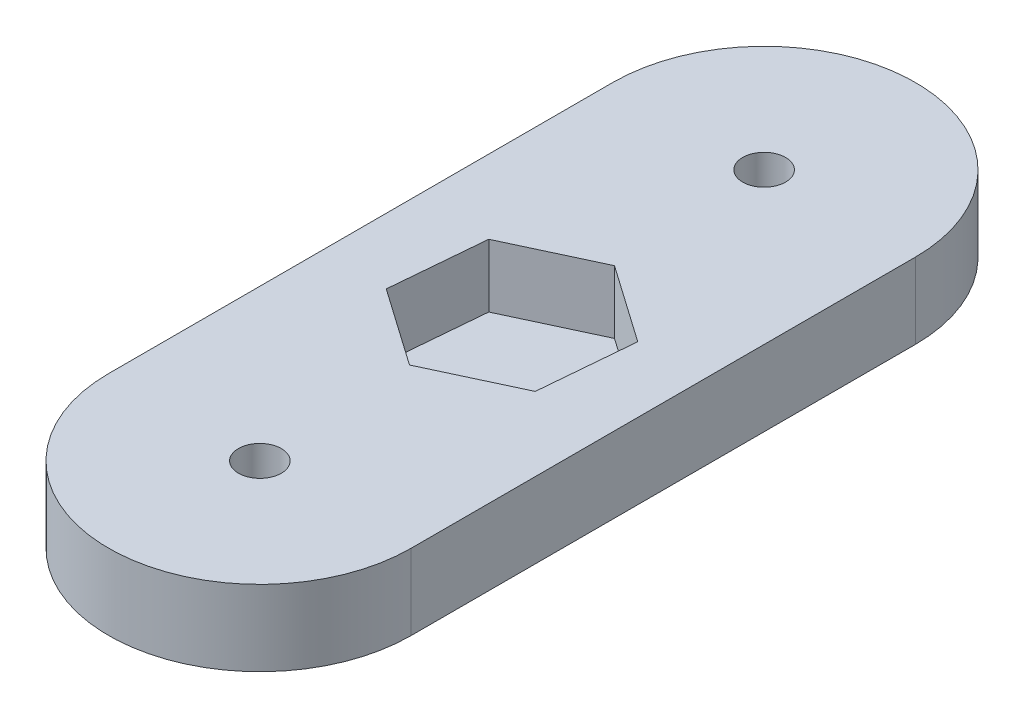
ISO-10303-21;
HEADER;
FILE_DESCRIPTION(('STEP AP214'),'2;1');
FILE_NAME('part.step','',(''),(''),'','','');
FILE_SCHEMA(('AUTOMOTIVE_DESIGN { 1 0 10303 214 1 1 1 1 }'));
ENDSEC;
DATA;
#1=APPLICATION_CONTEXT('core data for automotive mechanical design processes');
#2=APPLICATION_PROTOCOL_DEFINITION('international standard','automotive_design',2000,#1);
#3=PRODUCT_CONTEXT('',#1,'mechanical');
#4=PRODUCT('Part','Part','',(#3));
#5=PRODUCT_RELATED_PRODUCT_CATEGORY('part','',(#4));
#6=PRODUCT_DEFINITION_FORMATION('','',#4);
#7=PRODUCT_DEFINITION_CONTEXT('part definition',#1,'design');
#8=PRODUCT_DEFINITION('design','',#6,#7);
#9=PRODUCT_DEFINITION_SHAPE('','',#8);
#10=(LENGTH_UNIT() NAMED_UNIT(*) SI_UNIT(.MILLI.,.METRE.));
#11=(NAMED_UNIT(*) PLANE_ANGLE_UNIT() SI_UNIT($,.RADIAN.));
#12=(NAMED_UNIT(*) SI_UNIT($,.STERADIAN.) SOLID_ANGLE_UNIT());
#13=UNCERTAINTY_MEASURE_WITH_UNIT(LENGTH_MEASURE(1.E-05),#10,'distance_accuracy_value','');
#14=(GEOMETRIC_REPRESENTATION_CONTEXT(3) GLOBAL_UNCERTAINTY_ASSIGNED_CONTEXT((#13)) GLOBAL_UNIT_ASSIGNED_CONTEXT((#10,
#11,#12)) REPRESENTATION_CONTEXT('',''));
#15=CARTESIAN_POINT('',(0.,0.,0.));
#16=DIRECTION('',(0.,0.,1.));
#17=DIRECTION('',(1.,0.,0.));
#18=AXIS2_PLACEMENT_3D('',#15,#16,#17);
#19=CARTESIAN_POINT('',(0.,6.,0.));
#20=DIRECTION('',(0.,1.,0.));
#21=DIRECTION('',(0.,0.,1.));
#22=AXIS2_PLACEMENT_3D('',#19,#20,#21);
#23=PLANE('',#22);
#24=DIRECTION('',(0.906307787036648,0.,-0.422618261740703));
#25=VECTOR('',#24,1.);
#26=CARTESIAN_POINT('',(-0.654152089978134,6.,-12.5230073975889));
#27=LINE('',#26,#25);
#28=CARTESIAN_POINT('',(-0.654152089978134,6.,-12.5230073975889));
#29=VERTEX_POINT('',#28);
#30=CARTESIAN_POINT('',(6.14818949260728,6.,-15.6949913709347));
#31=VERTEX_POINT('',#30);
#32=EDGE_CURVE('E48',#29,#31,#27,.T.);
#33=ORIENTED_EDGE('',*,*,#32,.F.);
#34=DIRECTION('',(0.819152044288994,0.,0.573576436351043));
#35=VECTOR('',#34,1.);
#36=CARTESIAN_POINT('',(-6.80234158258542,6.,-16.8280160266542));
#37=LINE('',#36,#35);
#38=CARTESIAN_POINT('',(-6.80234158258542,6.,-16.8280160266542));
#39=VERTEX_POINT('',#38);
#40=EDGE_CURVE('E140',#39,#29,#37,.T.);
#41=ORIENTED_EDGE('',*,*,#40,.F.);
#42=DIRECTION('',(-0.087155742747654,0.,0.996194698091746));
#43=VECTOR('',#42,1.);
#44=CARTESIAN_POINT('',(-6.14818949260728,6.,-24.3050086290653));
#45=LINE('',#44,#43);
#46=CARTESIAN_POINT('',(-6.14818949260728,6.,-24.3050086290653));
#47=VERTEX_POINT('',#46);
#48=EDGE_CURVE('E143',#47,#39,#45,.T.);
#49=ORIENTED_EDGE('',*,*,#48,.F.);
#50=DIRECTION('',(-0.906307787036648,0.,0.422618261740703));
#51=VECTOR('',#50,1.);
#52=CARTESIAN_POINT('',(0.654152089978131,6.,-27.4769926024111));
#53=LINE('',#52,#51);
#54=CARTESIAN_POINT('',(0.654152089978131,6.,-27.4769926024111));
#55=VERTEX_POINT('',#54);
#56=EDGE_CURVE('E159',#55,#47,#53,.T.);
#57=ORIENTED_EDGE('',*,*,#56,.F.);
#58=DIRECTION('',(-0.819152044288995,0.,-0.573576436351042));
#59=VECTOR('',#58,1.);
#60=CARTESIAN_POINT('',(6.80234158258542,6.,-23.1719839733458));
#61=LINE('',#60,#59);
#62=CARTESIAN_POINT('',(6.80234158258542,6.,-23.1719839733458));
#63=VERTEX_POINT('',#62);
#64=EDGE_CURVE('E156',#63,#55,#61,.T.);
#65=ORIENTED_EDGE('',*,*,#64,.F.);
#66=DIRECTION('',(0.087155742747654,0.,-0.996194698091746));
#67=VECTOR('',#66,1.);
#68=CARTESIAN_POINT('',(6.14818949260728,6.,-15.6949913709347));
#69=LINE('',#68,#67);
#70=EDGE_CURVE('E154',#31,#63,#69,.T.);
#71=ORIENTED_EDGE('',*,*,#70,.F.);
#72=EDGE_LOOP('',(#33,#41,#49,#57,#65,#71));
#73=FACE_BOUND('',#72,.T.);
#74=CARTESIAN_POINT('',(0.,6.,-40.));
#75=DIRECTION('',(0.,1.,0.));
#76=DIRECTION('',(0.,0.,1.));
#77=AXIS2_PLACEMENT_3D('',#74,#75,#76);
#78=CIRCLE('',#77,1.7);
#79=CARTESIAN_POINT('',(0.,6.,-38.3));
#80=VERTEX_POINT('',#79);
#81=EDGE_CURVE('E180',#80,#80,#78,.T.);
#82=ORIENTED_EDGE('',*,*,#81,.F.);
#83=EDGE_LOOP('',(#82));
#84=FACE_BOUND('',#83,.T.);
#85=CARTESIAN_POINT('',(0.,6.,0.));
#86=DIRECTION('',(0.,1.,0.));
#87=DIRECTION('',(0.,0.,1.));
#88=AXIS2_PLACEMENT_3D('',#85,#86,#87);
#89=CIRCLE('',#88,12.);
#90=CARTESIAN_POINT('',(-12.,6.,0.));
#91=VERTEX_POINT('',#90);
#92=CARTESIAN_POINT('',(12.,6.,0.));
#93=VERTEX_POINT('',#92);
#94=EDGE_CURVE('E186',#91,#93,#89,.T.);
#95=ORIENTED_EDGE('',*,*,#94,.T.);
#96=DIRECTION('',(0.,0.,-1.));
#97=VECTOR('',#96,1.);
#98=CARTESIAN_POINT('',(12.,6.,0.));
#99=LINE('',#98,#97);
#100=CARTESIAN_POINT('',(12.,6.,-40.));
#101=VERTEX_POINT('',#100);
#102=EDGE_CURVE('E85',#93,#101,#99,.T.);
#103=ORIENTED_EDGE('',*,*,#102,.T.);
#104=CARTESIAN_POINT('',(0.,6.,-40.));
#105=DIRECTION('',(0.,1.,0.));
#106=DIRECTION('',(0.,0.,1.));
#107=AXIS2_PLACEMENT_3D('',#104,#105,#106);
#108=CIRCLE('',#107,12.);
#109=CARTESIAN_POINT('',(-12.,6.,-40.));
#110=VERTEX_POINT('',#109);
#111=EDGE_CURVE('E189',#101,#110,#108,.T.);
#112=ORIENTED_EDGE('',*,*,#111,.T.);
#113=DIRECTION('',(0.,0.,1.));
#114=VECTOR('',#113,1.);
#115=CARTESIAN_POINT('',(-12.,6.,0.));
#116=LINE('',#115,#114);
#117=EDGE_CURVE('E57',#110,#91,#116,.T.);
#118=ORIENTED_EDGE('',*,*,#117,.T.);
#119=EDGE_LOOP('',(#95,#103,#112,#118));
#120=FACE_BOUND('',#119,.T.);
#121=CARTESIAN_POINT('',(0.,6.,0.));
#122=DIRECTION('',(0.,1.,0.));
#123=DIRECTION('',(0.,0.,1.));
#124=AXIS2_PLACEMENT_3D('',#121,#122,#123);
#125=CIRCLE('',#124,1.7);
#126=CARTESIAN_POINT('',(0.,6.,1.7));
#127=VERTEX_POINT('',#126);
#128=EDGE_CURVE('E174',#127,#127,#125,.T.);
#129=ORIENTED_EDGE('',*,*,#128,.F.);
#130=EDGE_LOOP('',(#129));
#131=FACE_BOUND('',#130,.T.);
#132=ADVANCED_FACE('F33',(#73,#84,#120,#131),#23,.T.);
#133=CARTESIAN_POINT('',(0.,0.,0.));
#134=DIRECTION('',(0.,1.,0.));
#135=DIRECTION('',(0.,0.,1.));
#136=AXIS2_PLACEMENT_3D('',#133,#134,#135);
#137=PLANE('',#136);
#138=CARTESIAN_POINT('',(0.,0.,-40.));
#139=DIRECTION('',(0.,1.,0.));
#140=DIRECTION('',(0.,0.,1.));
#141=AXIS2_PLACEMENT_3D('',#138,#139,#140);
#142=CIRCLE('',#141,1.7);
#143=CARTESIAN_POINT('',(0.,0.,-38.3));
#144=VERTEX_POINT('',#143);
#145=EDGE_CURVE('E177',#144,#144,#142,.T.);
#146=ORIENTED_EDGE('',*,*,#145,.T.);
#147=EDGE_LOOP('',(#146));
#148=FACE_BOUND('',#147,.T.);
#149=CARTESIAN_POINT('',(0.,0.,0.));
#150=DIRECTION('',(0.,1.,0.));
#151=DIRECTION('',(0.,0.,1.));
#152=AXIS2_PLACEMENT_3D('',#149,#150,#151);
#153=CIRCLE('',#152,12.);
#154=CARTESIAN_POINT('',(-12.,0.,0.));
#155=VERTEX_POINT('',#154);
#156=CARTESIAN_POINT('',(12.,0.,0.));
#157=VERTEX_POINT('',#156);
#158=EDGE_CURVE('E183',#155,#157,#153,.T.);
#159=ORIENTED_EDGE('',*,*,#158,.F.);
#160=DIRECTION('',(0.,0.,1.));
#161=VECTOR('',#160,1.);
#162=CARTESIAN_POINT('',(-12.,0.,0.));
#163=LINE('',#162,#161);
#164=CARTESIAN_POINT('',(-12.,0.,-40.));
#165=VERTEX_POINT('',#164);
#166=EDGE_CURVE('E78',#165,#155,#163,.T.);
#167=ORIENTED_EDGE('',*,*,#166,.F.);
#168=CARTESIAN_POINT('',(0.,0.,-40.));
#169=DIRECTION('',(0.,1.,0.));
#170=DIRECTION('',(0.,0.,1.));
#171=AXIS2_PLACEMENT_3D('',#168,#169,#170);
#172=CIRCLE('',#171,12.);
#173=CARTESIAN_POINT('',(12.,0.,-40.));
#174=VERTEX_POINT('',#173);
#175=EDGE_CURVE('E197',#174,#165,#172,.T.);
#176=ORIENTED_EDGE('',*,*,#175,.F.);
#177=DIRECTION('',(0.,0.,-1.));
#178=VECTOR('',#177,1.);
#179=CARTESIAN_POINT('',(12.,0.,0.));
#180=LINE('',#179,#178);
#181=EDGE_CURVE('E195',#157,#174,#180,.T.);
#182=ORIENTED_EDGE('',*,*,#181,.F.);
#183=EDGE_LOOP('',(#159,#167,#176,#182));
#184=FACE_BOUND('',#183,.T.);
#185=CARTESIAN_POINT('',(0.,0.,0.));
#186=DIRECTION('',(0.,1.,0.));
#187=DIRECTION('',(0.,0.,1.));
#188=AXIS2_PLACEMENT_3D('',#185,#186,#187);
#189=CIRCLE('',#188,1.7);
#190=CARTESIAN_POINT('',(0.,0.,1.7));
#191=VERTEX_POINT('',#190);
#192=EDGE_CURVE('E166',#191,#191,#189,.T.);
#193=ORIENTED_EDGE('',*,*,#192,.T.);
#194=EDGE_LOOP('',(#193));
#195=FACE_BOUND('',#194,.T.);
#196=ADVANCED_FACE('F210',(#148,#184,#195),#137,.F.);
#197=CARTESIAN_POINT('',(0.,6.,0.));
#198=DIRECTION('',(0.,-1.,0.));
#199=DIRECTION('',(0.,0.,-1.));
#200=AXIS2_PLACEMENT_3D('',#197,#198,#199);
#201=CYLINDRICAL_SURFACE('',#200,12.);
#202=ORIENTED_EDGE('',*,*,#158,.T.);
#203=DIRECTION('',(0.,-1.,0.));
#204=VECTOR('',#203,1.);
#205=CARTESIAN_POINT('',(12.,6.,0.));
#206=LINE('',#205,#204);
#207=EDGE_CURVE('E11',#93,#157,#206,.T.);
#208=ORIENTED_EDGE('',*,*,#207,.F.);
#209=ORIENTED_EDGE('',*,*,#94,.F.);
#210=DIRECTION('',(0.,-1.,0.));
#211=VECTOR('',#210,1.);
#212=CARTESIAN_POINT('',(-12.,6.,0.));
#213=LINE('',#212,#211);
#214=EDGE_CURVE('E192',#91,#155,#213,.T.);
#215=ORIENTED_EDGE('',*,*,#214,.T.);
#216=EDGE_LOOP('',(#202,#208,#209,#215));
#217=FACE_BOUND('',#216,.T.);
#218=ADVANCED_FACE('F35',(#217),#201,.T.);
#219=CARTESIAN_POINT('',(12.,6.,0.));
#220=DIRECTION('',(-1.,0.,0.));
#221=DIRECTION('',(0.,0.,1.));
#222=AXIS2_PLACEMENT_3D('',#219,#220,#221);
#223=PLANE('',#222);
#224=ORIENTED_EDGE('',*,*,#181,.T.);
#225=DIRECTION('',(0.,-1.,0.));
#226=VECTOR('',#225,1.);
#227=CARTESIAN_POINT('',(12.,6.,-40.));
#228=LINE('',#227,#226);
#229=EDGE_CURVE('E41',#101,#174,#228,.T.);
#230=ORIENTED_EDGE('',*,*,#229,.F.);
#231=ORIENTED_EDGE('',*,*,#102,.F.);
#232=ORIENTED_EDGE('',*,*,#207,.T.);
#233=EDGE_LOOP('',(#224,#230,#231,#232));
#234=FACE_BOUND('',#233,.T.);
#235=ADVANCED_FACE('F226',(#234),#223,.F.);
#236=CARTESIAN_POINT('',(0.,6.,-40.));
#237=DIRECTION('',(0.,-1.,0.));
#238=DIRECTION('',(0.,0.,-1.));
#239=AXIS2_PLACEMENT_3D('',#236,#237,#238);
#240=CYLINDRICAL_SURFACE('',#239,12.);
#241=ORIENTED_EDGE('',*,*,#175,.T.);
#242=DIRECTION('',(0.,-1.,0.));
#243=VECTOR('',#242,1.);
#244=CARTESIAN_POINT('',(-12.,6.,-40.));
#245=LINE('',#244,#243);
#246=EDGE_CURVE('E201',#110,#165,#245,.T.);
#247=ORIENTED_EDGE('',*,*,#246,.F.);
#248=ORIENTED_EDGE('',*,*,#111,.F.);
#249=ORIENTED_EDGE('',*,*,#229,.T.);
#250=EDGE_LOOP('',(#241,#247,#248,#249));
#251=FACE_BOUND('',#250,.T.);
#252=ADVANCED_FACE('F206',(#251),#240,.T.);
#253=CARTESIAN_POINT('',(-12.,6.,0.));
#254=DIRECTION('',(1.,0.,0.));
#255=DIRECTION('',(0.,0.,-1.));
#256=AXIS2_PLACEMENT_3D('',#253,#254,#255);
#257=PLANE('',#256);
#258=ORIENTED_EDGE('',*,*,#166,.T.);
#259=ORIENTED_EDGE('',*,*,#214,.F.);
#260=ORIENTED_EDGE('',*,*,#117,.F.);
#261=ORIENTED_EDGE('',*,*,#246,.T.);
#262=EDGE_LOOP('',(#258,#259,#260,#261));
#263=FACE_BOUND('',#262,.T.);
#264=ADVANCED_FACE('F215',(#263),#257,.F.);
#265=CARTESIAN_POINT('',(0.,6.,-40.));
#266=DIRECTION('',(0.,-1.,0.));
#267=DIRECTION('',(0.,0.,-1.));
#268=AXIS2_PLACEMENT_3D('',#265,#266,#267);
#269=CYLINDRICAL_SURFACE('',#268,1.7);
#270=ORIENTED_EDGE('',*,*,#81,.T.);
#271=EDGE_LOOP('',(#270));
#272=FACE_BOUND('',#271,.T.);
#273=ORIENTED_EDGE('',*,*,#145,.F.);
#274=EDGE_LOOP('',(#273));
#275=FACE_BOUND('',#274,.T.);
#276=ADVANCED_FACE('F217',(#272,#275),#269,.F.);
#277=CARTESIAN_POINT('',(0.,6.,0.));
#278=DIRECTION('',(0.,-1.,0.));
#279=DIRECTION('',(0.,0.,-1.));
#280=AXIS2_PLACEMENT_3D('',#277,#278,#279);
#281=CYLINDRICAL_SURFACE('',#280,1.7);
#282=ORIENTED_EDGE('',*,*,#128,.T.);
#283=EDGE_LOOP('',(#282));
#284=FACE_BOUND('',#283,.T.);
#285=ORIENTED_EDGE('',*,*,#192,.F.);
#286=EDGE_LOOP('',(#285));
#287=FACE_BOUND('',#286,.T.);
#288=ADVANCED_FACE('F223',(#284,#287),#281,.F.);
#289=CARTESIAN_POINT('',(-0.654152089978134,1.,-12.5230073975889));
#290=DIRECTION('',(0.422618261740703,0.,0.906307787036648));
#291=DIRECTION('',(0.906307787036648,0.,-0.422618261740703));
#292=AXIS2_PLACEMENT_3D('',#289,#290,#291);
#293=PLANE('',#292);
#294=ORIENTED_EDGE('',*,*,#32,.T.);
#295=DIRECTION('',(0.,1.,0.));
#296=VECTOR('',#295,1.);
#297=CARTESIAN_POINT('',(6.14818949260728,1.,-15.6949913709347));
#298=LINE('',#297,#296);
#299=CARTESIAN_POINT('',(6.14818949260728,1.,-15.6949913709347));
#300=VERTEX_POINT('',#299);
#301=EDGE_CURVE('E117',#300,#31,#298,.T.);
#302=ORIENTED_EDGE('',*,*,#301,.F.);
#303=DIRECTION('',(0.906307787036648,0.,-0.422618261740703));
#304=VECTOR('',#303,1.);
#305=CARTESIAN_POINT('',(-0.654152089978134,1.,-12.5230073975889));
#306=LINE('',#305,#304);
#307=CARTESIAN_POINT('',(-0.654152089978134,1.,-12.5230073975889));
#308=VERTEX_POINT('',#307);
#309=EDGE_CURVE('E121',#308,#300,#306,.T.);
#310=ORIENTED_EDGE('',*,*,#309,.F.);
#311=DIRECTION('',(0.,1.,0.));
#312=VECTOR('',#311,1.);
#313=CARTESIAN_POINT('',(-0.654152089978134,1.,-12.5230073975889));
#314=LINE('',#313,#312);
#315=EDGE_CURVE('E164',#308,#29,#314,.T.);
#316=ORIENTED_EDGE('',*,*,#315,.T.);
#317=EDGE_LOOP('',(#294,#302,#310,#316));
#318=FACE_BOUND('',#317,.T.);
#319=ADVANCED_FACE('F119',(#318),#293,.F.);
#320=CARTESIAN_POINT('',(-6.80234158258542,1.,-16.8280160266542));
#321=DIRECTION('',(-0.573576436351043,0.,0.819152044288994));
#322=DIRECTION('',(0.819152044288994,0.,0.573576436351043));
#323=AXIS2_PLACEMENT_3D('',#320,#321,#322);
#324=PLANE('',#323);
#325=ORIENTED_EDGE('',*,*,#40,.T.);
#326=ORIENTED_EDGE('',*,*,#315,.F.);
#327=DIRECTION('',(0.819152044288994,0.,0.573576436351043));
#328=VECTOR('',#327,1.);
#329=CARTESIAN_POINT('',(-6.80234158258542,1.,-16.8280160266542));
#330=LINE('',#329,#328);
#331=CARTESIAN_POINT('',(-6.80234158258542,1.,-16.8280160266542));
#332=VERTEX_POINT('',#331);
#333=EDGE_CURVE('E127',#332,#308,#330,.T.);
#334=ORIENTED_EDGE('',*,*,#333,.F.);
#335=DIRECTION('',(0.,1.,0.));
#336=VECTOR('',#335,1.);
#337=CARTESIAN_POINT('',(-6.80234158258542,1.,-16.8280160266542));
#338=LINE('',#337,#336);
#339=EDGE_CURVE('E167',#332,#39,#338,.T.);
#340=ORIENTED_EDGE('',*,*,#339,.T.);
#341=EDGE_LOOP('',(#325,#326,#334,#340));
#342=FACE_BOUND('',#341,.T.);
#343=ADVANCED_FACE('F243',(#342),#324,.F.);
#344=CARTESIAN_POINT('',(-6.14818949260728,1.,-24.3050086290653));
#345=DIRECTION('',(-0.996194698091746,0.,-0.0871557427476541));
#346=DIRECTION('',(-0.0871557427476541,0.,0.996194698091746));
#347=AXIS2_PLACEMENT_3D('',#344,#345,#346);
#348=PLANE('',#347);
#349=ORIENTED_EDGE('',*,*,#48,.T.);
#350=ORIENTED_EDGE('',*,*,#339,.F.);
#351=DIRECTION('',(-0.087155742747654,0.,0.996194698091746));
#352=VECTOR('',#351,1.);
#353=CARTESIAN_POINT('',(-6.14818949260728,1.,-24.3050086290653));
#354=LINE('',#353,#352);
#355=CARTESIAN_POINT('',(-6.14818949260728,1.,-24.3050086290653));
#356=VERTEX_POINT('',#355);
#357=EDGE_CURVE('E150',#356,#332,#354,.T.);
#358=ORIENTED_EDGE('',*,*,#357,.F.);
#359=DIRECTION('',(0.,1.,0.));
#360=VECTOR('',#359,1.);
#361=CARTESIAN_POINT('',(-6.14818949260728,1.,-24.3050086290653));
#362=LINE('',#361,#360);
#363=EDGE_CURVE('E169',#356,#47,#362,.T.);
#364=ORIENTED_EDGE('',*,*,#363,.T.);
#365=EDGE_LOOP('',(#349,#350,#358,#364));
#366=FACE_BOUND('',#365,.T.);
#367=ADVANCED_FACE('F253',(#366),#348,.F.);
#368=CARTESIAN_POINT('',(0.654152089978131,1.,-27.4769926024111));
#369=DIRECTION('',(-0.422618261740703,0.,-0.906307787036648));
#370=DIRECTION('',(-0.906307787036648,0.,0.422618261740703));
#371=AXIS2_PLACEMENT_3D('',#368,#369,#370);
#372=PLANE('',#371);
#373=ORIENTED_EDGE('',*,*,#56,.T.);
#374=ORIENTED_EDGE('',*,*,#363,.F.);
#375=DIRECTION('',(-0.906307787036648,0.,0.422618261740703));
#376=VECTOR('',#375,1.);
#377=CARTESIAN_POINT('',(0.654152089978131,1.,-27.4769926024111));
#378=LINE('',#377,#376);
#379=CARTESIAN_POINT('',(0.654152089978131,1.,-27.4769926024111));
#380=VERTEX_POINT('',#379);
#381=EDGE_CURVE('E147',#380,#356,#378,.T.);
#382=ORIENTED_EDGE('',*,*,#381,.F.);
#383=DIRECTION('',(0.,1.,0.));
#384=VECTOR('',#383,1.);
#385=CARTESIAN_POINT('',(0.654152089978131,1.,-27.4769926024111));
#386=LINE('',#385,#384);
#387=EDGE_CURVE('E171',#380,#55,#386,.T.);
#388=ORIENTED_EDGE('',*,*,#387,.T.);
#389=EDGE_LOOP('',(#373,#374,#382,#388));
#390=FACE_BOUND('',#389,.T.);
#391=ADVANCED_FACE('F249',(#390),#372,.F.);
#392=CARTESIAN_POINT('',(6.80234158258542,1.,-23.1719839733458));
#393=DIRECTION('',(0.573576436351042,0.,-0.819152044288995));
#394=DIRECTION('',(-0.819152044288995,0.,-0.573576436351042));
#395=AXIS2_PLACEMENT_3D('',#392,#393,#394);
#396=PLANE('',#395);
#397=ORIENTED_EDGE('',*,*,#64,.T.);
#398=ORIENTED_EDGE('',*,*,#387,.F.);
#399=DIRECTION('',(-0.819152044288995,0.,-0.573576436351042));
#400=VECTOR('',#399,1.);
#401=CARTESIAN_POINT('',(6.80234158258542,1.,-23.1719839733458));
#402=LINE('',#401,#400);
#403=CARTESIAN_POINT('',(6.80234158258542,1.,-23.1719839733458));
#404=VERTEX_POINT('',#403);
#405=EDGE_CURVE('E135',#404,#380,#402,.T.);
#406=ORIENTED_EDGE('',*,*,#405,.F.);
#407=DIRECTION('',(0.,1.,0.));
#408=VECTOR('',#407,1.);
#409=CARTESIAN_POINT('',(6.80234158258542,1.,-23.1719839733458));
#410=LINE('',#409,#408);
#411=EDGE_CURVE('E126',#404,#63,#410,.T.);
#412=ORIENTED_EDGE('',*,*,#411,.T.);
#413=EDGE_LOOP('',(#397,#398,#406,#412));
#414=FACE_BOUND('',#413,.T.);
#415=ADVANCED_FACE('F246',(#414),#396,.F.);
#416=CARTESIAN_POINT('',(6.14818949260728,1.,-15.6949913709347));
#417=DIRECTION('',(0.996194698091746,0.,0.087155742747654));
#418=DIRECTION('',(0.087155742747654,0.,-0.996194698091746));
#419=AXIS2_PLACEMENT_3D('',#416,#417,#418);
#420=PLANE('',#419);
#421=ORIENTED_EDGE('',*,*,#70,.T.);
#422=ORIENTED_EDGE('',*,*,#411,.F.);
#423=DIRECTION('',(0.087155742747654,0.,-0.996194698091746));
#424=VECTOR('',#423,1.);
#425=CARTESIAN_POINT('',(6.14818949260728,1.,-15.6949913709347));
#426=LINE('',#425,#424);
#427=EDGE_CURVE('E130',#300,#404,#426,.T.);
#428=ORIENTED_EDGE('',*,*,#427,.F.);
#429=ORIENTED_EDGE('',*,*,#301,.T.);
#430=EDGE_LOOP('',(#421,#422,#428,#429));
#431=FACE_BOUND('',#430,.T.);
#432=ADVANCED_FACE('F131',(#431),#420,.F.);
#433=CARTESIAN_POINT('',(0.,1.,0.));
#434=DIRECTION('',(0.,1.,0.));
#435=DIRECTION('',(0.,0.,1.));
#436=AXIS2_PLACEMENT_3D('',#433,#434,#435);
#437=PLANE('',#436);
#438=ORIENTED_EDGE('',*,*,#309,.T.);
#439=ORIENTED_EDGE('',*,*,#427,.T.);
#440=ORIENTED_EDGE('',*,*,#405,.T.);
#441=ORIENTED_EDGE('',*,*,#381,.T.);
#442=ORIENTED_EDGE('',*,*,#357,.T.);
#443=ORIENTED_EDGE('',*,*,#333,.T.);
#444=EDGE_LOOP('',(#438,#439,#440,#441,#442,#443));
#445=FACE_BOUND('',#444,.T.);
#446=ADVANCED_FACE('F137',(#445),#437,.T.);
#447=CLOSED_SHELL('',(#132,#196,#218,#235,#252,#264,#276,#288,#319,#343,#367,#391,#415,#432,#446));
#448=MANIFOLD_SOLID_BREP('B2',#447);
#449=ADVANCED_BREP_SHAPE_REPRESENTATION('',(#18,#448),#14);
#450=SHAPE_DEFINITION_REPRESENTATION(#9,#449);
ENDSEC;
END-ISO-10303-21;
